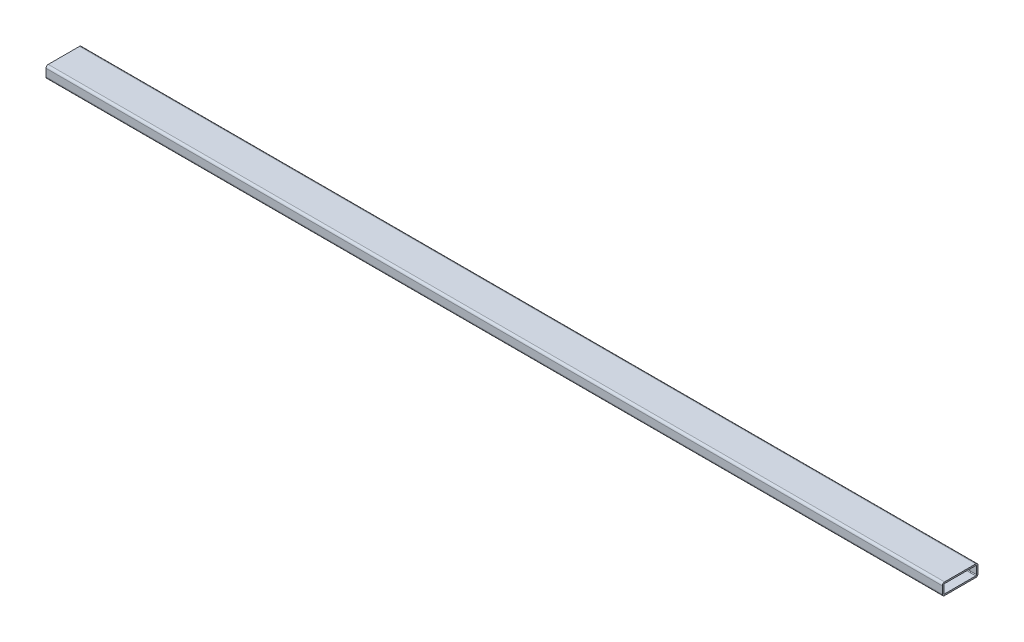
ISO-10303-21;
HEADER;
FILE_DESCRIPTION(('STEP AP214'),'2;1');
FILE_NAME('part.step','',(''),(''),'','','');
FILE_SCHEMA(('AUTOMOTIVE_DESIGN { 1 0 10303 214 1 1 1 1 }'));
ENDSEC;
DATA;
#1=APPLICATION_CONTEXT('core data for automotive mechanical design processes');
#2=APPLICATION_PROTOCOL_DEFINITION('international standard','automotive_design',2000,#1);
#3=PRODUCT_CONTEXT('',#1,'mechanical');
#4=PRODUCT('Part','Part','',(#3));
#5=PRODUCT_RELATED_PRODUCT_CATEGORY('part','',(#4));
#6=PRODUCT_DEFINITION_FORMATION('','',#4);
#7=PRODUCT_DEFINITION_CONTEXT('part definition',#1,'design');
#8=PRODUCT_DEFINITION('design','',#6,#7);
#9=PRODUCT_DEFINITION_SHAPE('','',#8);
#10=(LENGTH_UNIT() NAMED_UNIT(*) SI_UNIT(.MILLI.,.METRE.));
#11=(NAMED_UNIT(*) PLANE_ANGLE_UNIT() SI_UNIT($,.RADIAN.));
#12=(NAMED_UNIT(*) SI_UNIT($,.STERADIAN.) SOLID_ANGLE_UNIT());
#13=UNCERTAINTY_MEASURE_WITH_UNIT(LENGTH_MEASURE(1.E-05),#10,'distance_accuracy_value','');
#14=(GEOMETRIC_REPRESENTATION_CONTEXT(3) GLOBAL_UNCERTAINTY_ASSIGNED_CONTEXT((#13)) GLOBAL_UNIT_ASSIGNED_CONTEXT((#10,
#11,#12)) REPRESENTATION_CONTEXT('',''));
#15=CARTESIAN_POINT('',(0.,0.,0.));
#16=DIRECTION('',(0.,0.,1.));
#17=DIRECTION('',(1.,0.,0.));
#18=AXIS2_PLACEMENT_3D('',#15,#16,#17);
#19=CARTESIAN_POINT('',(957.2625,20.6248,-33.3248));
#20=DIRECTION('',(1.,0.,0.));
#21=DIRECTION('',(0.,0.,-1.));
#22=AXIS2_PLACEMENT_3D('',#19,#20,#21);
#23=PLANE('',#22);
#24=CARTESIAN_POINT('',(957.2625,20.6248,-33.3248));
#25=DIRECTION('',(1.,0.,0.));
#26=DIRECTION('',(0.,0.,-1.));
#27=AXIS2_PLACEMENT_3D('',#24,#25,#26);
#28=CIRCLE('',#27,4.77519999999999);
#29=CARTESIAN_POINT('',(957.2625,20.6248,-38.1));
#30=VERTEX_POINT('',#29);
#31=CARTESIAN_POINT('',(957.2625,25.4,-33.3248));
#32=VERTEX_POINT('',#31);
#33=EDGE_CURVE('E213',#30,#32,#28,.T.);
#34=ORIENTED_EDGE('',*,*,#33,.T.);
#35=DIRECTION('',(0.,0.,1.));
#36=VECTOR('',#35,1.);
#37=CARTESIAN_POINT('',(957.2625,25.4,-33.3248));
#38=LINE('',#37,#36);
#39=CARTESIAN_POINT('',(957.2625,25.4,33.3248));
#40=VERTEX_POINT('',#39);
#41=EDGE_CURVE('E216',#32,#40,#38,.T.);
#42=ORIENTED_EDGE('',*,*,#41,.T.);
#43=CARTESIAN_POINT('',(957.2625,20.6248,33.3248));
#44=DIRECTION('',(1.,0.,0.));
#45=DIRECTION('',(0.,0.,1.));
#46=AXIS2_PLACEMENT_3D('',#43,#44,#45);
#47=CIRCLE('',#46,4.77519999999999);
#48=CARTESIAN_POINT('',(957.2625,20.6248,38.1));
#49=VERTEX_POINT('',#48);
#50=EDGE_CURVE('E219',#40,#49,#47,.T.);
#51=ORIENTED_EDGE('',*,*,#50,.T.);
#52=DIRECTION('',(0.,-1.,0.));
#53=VECTOR('',#52,1.);
#54=CARTESIAN_POINT('',(957.2625,20.6248,38.1));
#55=LINE('',#54,#53);
#56=CARTESIAN_POINT('',(957.2625,4.77519999999999,38.1));
#57=VERTEX_POINT('',#56);
#58=EDGE_CURVE('E221',#49,#57,#55,.T.);
#59=ORIENTED_EDGE('',*,*,#58,.T.);
#60=CARTESIAN_POINT('',(957.2625,4.77519999999999,33.3248));
#61=DIRECTION('',(1.,0.,0.));
#62=DIRECTION('',(0.,0.,1.));
#63=AXIS2_PLACEMENT_3D('',#60,#61,#62);
#64=CIRCLE('',#63,4.7752);
#65=CARTESIAN_POINT('',(957.2625,0.,33.3248));
#66=VERTEX_POINT('',#65);
#67=EDGE_CURVE('E223',#57,#66,#64,.T.);
#68=ORIENTED_EDGE('',*,*,#67,.T.);
#69=DIRECTION('',(0.,0.,-1.));
#70=VECTOR('',#69,1.);
#71=CARTESIAN_POINT('',(957.2625,0.,-33.3248));
#72=LINE('',#71,#70);
#73=CARTESIAN_POINT('',(957.2625,0.,-33.3248));
#74=VERTEX_POINT('',#73);
#75=EDGE_CURVE('E225',#66,#74,#72,.T.);
#76=ORIENTED_EDGE('',*,*,#75,.T.);
#77=CARTESIAN_POINT('',(957.2625,4.77520000000001,-33.3248));
#78=DIRECTION('',(1.,0.,0.));
#79=DIRECTION('',(0.,0.,1.));
#80=AXIS2_PLACEMENT_3D('',#77,#78,#79);
#81=CIRCLE('',#80,4.7752);
#82=CARTESIAN_POINT('',(957.2625,4.77520000000001,-38.1));
#83=VERTEX_POINT('',#82);
#84=EDGE_CURVE('E227',#74,#83,#81,.T.);
#85=ORIENTED_EDGE('',*,*,#84,.T.);
#86=DIRECTION('',(0.,1.,0.));
#87=VECTOR('',#86,1.);
#88=CARTESIAN_POINT('',(957.2625,20.6248,-38.1));
#89=LINE('',#88,#87);
#90=EDGE_CURVE('E229',#83,#30,#89,.T.);
#91=ORIENTED_EDGE('',*,*,#90,.T.);
#92=EDGE_LOOP('',(#34,#42,#51,#59,#68,#76,#85,#91));
#93=FACE_BOUND('',#92,.T.);
#94=DIRECTION('',(0.,0.,1.));
#95=VECTOR('',#94,1.);
#96=CARTESIAN_POINT('',(957.2625,22.225,-33.3248));
#97=LINE('',#96,#95);
#98=CARTESIAN_POINT('',(957.2625,22.225,-33.3248));
#99=VERTEX_POINT('',#98);
#100=CARTESIAN_POINT('',(957.2625,22.225,33.3248));
#101=VERTEX_POINT('',#100);
#102=EDGE_CURVE('E156',#99,#101,#97,.T.);
#103=ORIENTED_EDGE('',*,*,#102,.F.);
#104=CARTESIAN_POINT('',(957.2625,20.6248,-33.3248));
#105=DIRECTION('',(1.,0.,0.));
#106=DIRECTION('',(0.,0.,-1.));
#107=AXIS2_PLACEMENT_3D('',#104,#105,#106);
#108=CIRCLE('',#107,1.6002);
#109=CARTESIAN_POINT('',(957.2625,20.6248,-34.925));
#110=VERTEX_POINT('',#109);
#111=EDGE_CURVE('E148',#110,#99,#108,.T.);
#112=ORIENTED_EDGE('',*,*,#111,.F.);
#113=DIRECTION('',(0.,1.,0.));
#114=VECTOR('',#113,1.);
#115=CARTESIAN_POINT('',(957.2625,20.6248,-34.925));
#116=LINE('',#115,#114);
#117=CARTESIAN_POINT('',(957.2625,4.77520000000001,-34.925));
#118=VERTEX_POINT('',#117);
#119=EDGE_CURVE('E181',#118,#110,#116,.T.);
#120=ORIENTED_EDGE('',*,*,#119,.F.);
#121=CARTESIAN_POINT('',(957.2625,4.77520000000001,-33.3248));
#122=DIRECTION('',(1.,0.,0.));
#123=DIRECTION('',(0.,0.,1.));
#124=AXIS2_PLACEMENT_3D('',#121,#122,#123);
#125=CIRCLE('',#124,1.6002);
#126=CARTESIAN_POINT('',(957.2625,3.17500000000001,-33.3248));
#127=VERTEX_POINT('',#126);
#128=EDGE_CURVE('E179',#127,#118,#125,.T.);
#129=ORIENTED_EDGE('',*,*,#128,.F.);
#130=DIRECTION('',(0.,0.,-1.));
#131=VECTOR('',#130,1.);
#132=CARTESIAN_POINT('',(957.2625,3.17500000000001,-33.3248));
#133=LINE('',#132,#131);
#134=CARTESIAN_POINT('',(957.2625,3.17499999999999,33.3248));
#135=VERTEX_POINT('',#134);
#136=EDGE_CURVE('E177',#135,#127,#133,.T.);
#137=ORIENTED_EDGE('',*,*,#136,.F.);
#138=CARTESIAN_POINT('',(957.2625,4.77519999999999,33.3248));
#139=DIRECTION('',(1.,0.,0.));
#140=DIRECTION('',(0.,0.,1.));
#141=AXIS2_PLACEMENT_3D('',#138,#139,#140);
#142=CIRCLE('',#141,1.60020000000001);
#143=CARTESIAN_POINT('',(957.2625,4.77519999999999,34.925));
#144=VERTEX_POINT('',#143);
#145=EDGE_CURVE('E175',#144,#135,#142,.T.);
#146=ORIENTED_EDGE('',*,*,#145,.F.);
#147=DIRECTION('',(0.,-1.,0.));
#148=VECTOR('',#147,1.);
#149=CARTESIAN_POINT('',(957.2625,20.6248,34.925));
#150=LINE('',#149,#148);
#151=CARTESIAN_POINT('',(957.2625,20.6248,34.925));
#152=VERTEX_POINT('',#151);
#153=EDGE_CURVE('E171',#152,#144,#150,.T.);
#154=ORIENTED_EDGE('',*,*,#153,.F.);
#155=CARTESIAN_POINT('',(957.2625,20.6248,33.3248));
#156=DIRECTION('',(1.,0.,0.));
#157=DIRECTION('',(0.,0.,1.));
#158=AXIS2_PLACEMENT_3D('',#155,#156,#157);
#159=CIRCLE('',#158,1.60020000000001);
#160=EDGE_CURVE('E169',#101,#152,#159,.T.);
#161=ORIENTED_EDGE('',*,*,#160,.F.);
#162=EDGE_LOOP('',(#103,#112,#120,#129,#137,#146,#154,#161));
#163=FACE_BOUND('',#162,.T.);
#164=ADVANCED_FACE('F35',(#93,#163),#23,.T.);
#165=CARTESIAN_POINT('',(-957.2625,20.6248,-33.3248));
#166=DIRECTION('',(1.,0.,0.));
#167=DIRECTION('',(0.,0.,-1.));
#168=AXIS2_PLACEMENT_3D('',#165,#166,#167);
#169=PLANE('',#168);
#170=CARTESIAN_POINT('',(-957.2625,20.6248,-33.3248));
#171=DIRECTION('',(1.,0.,0.));
#172=DIRECTION('',(0.,0.,-1.));
#173=AXIS2_PLACEMENT_3D('',#170,#171,#172);
#174=CIRCLE('',#173,4.77519999999999);
#175=CARTESIAN_POINT('',(-957.2625,20.6248,-38.1));
#176=VERTEX_POINT('',#175);
#177=CARTESIAN_POINT('',(-957.2625,25.4,-33.3248));
#178=VERTEX_POINT('',#177);
#179=EDGE_CURVE('E164',#176,#178,#174,.T.);
#180=ORIENTED_EDGE('',*,*,#179,.F.);
#181=DIRECTION('',(0.,1.,0.));
#182=VECTOR('',#181,1.);
#183=CARTESIAN_POINT('',(-957.2625,20.6248,-38.1));
#184=LINE('',#183,#182);
#185=CARTESIAN_POINT('',(-957.2625,4.77520000000001,-38.1));
#186=VERTEX_POINT('',#185);
#187=EDGE_CURVE('E217',#186,#176,#184,.T.);
#188=ORIENTED_EDGE('',*,*,#187,.F.);
#189=CARTESIAN_POINT('',(-957.2625,4.77520000000001,-33.3248));
#190=DIRECTION('',(1.,0.,0.));
#191=DIRECTION('',(0.,0.,1.));
#192=AXIS2_PLACEMENT_3D('',#189,#190,#191);
#193=CIRCLE('',#192,4.7752);
#194=CARTESIAN_POINT('',(-957.2625,0.,-33.3248));
#195=VERTEX_POINT('',#194);
#196=EDGE_CURVE('E244',#195,#186,#193,.T.);
#197=ORIENTED_EDGE('',*,*,#196,.F.);
#198=DIRECTION('',(0.,0.,-1.));
#199=VECTOR('',#198,1.);
#200=CARTESIAN_POINT('',(-957.2625,0.,-33.3248));
#201=LINE('',#200,#199);
#202=CARTESIAN_POINT('',(-957.2625,0.,33.3248));
#203=VERTEX_POINT('',#202);
#204=EDGE_CURVE('E242',#203,#195,#201,.T.);
#205=ORIENTED_EDGE('',*,*,#204,.F.);
#206=CARTESIAN_POINT('',(-957.2625,4.77519999999999,33.3248));
#207=DIRECTION('',(1.,0.,0.));
#208=DIRECTION('',(0.,0.,1.));
#209=AXIS2_PLACEMENT_3D('',#206,#207,#208);
#210=CIRCLE('',#209,4.7752);
#211=CARTESIAN_POINT('',(-957.2625,4.77519999999999,38.1));
#212=VERTEX_POINT('',#211);
#213=EDGE_CURVE('E240',#212,#203,#210,.T.);
#214=ORIENTED_EDGE('',*,*,#213,.F.);
#215=DIRECTION('',(0.,-1.,0.));
#216=VECTOR('',#215,1.);
#217=CARTESIAN_POINT('',(-957.2625,20.6248,38.1));
#218=LINE('',#217,#216);
#219=CARTESIAN_POINT('',(-957.2625,20.6248,38.1));
#220=VERTEX_POINT('',#219);
#221=EDGE_CURVE('E238',#220,#212,#218,.T.);
#222=ORIENTED_EDGE('',*,*,#221,.F.);
#223=CARTESIAN_POINT('',(-957.2625,20.6248,33.3248));
#224=DIRECTION('',(1.,0.,0.));
#225=DIRECTION('',(0.,0.,1.));
#226=AXIS2_PLACEMENT_3D('',#223,#224,#225);
#227=CIRCLE('',#226,4.77519999999999);
#228=CARTESIAN_POINT('',(-957.2625,25.4,33.3248));
#229=VERTEX_POINT('',#228);
#230=EDGE_CURVE('E236',#229,#220,#227,.T.);
#231=ORIENTED_EDGE('',*,*,#230,.F.);
#232=DIRECTION('',(0.,0.,1.));
#233=VECTOR('',#232,1.);
#234=CARTESIAN_POINT('',(-957.2625,25.4,-33.3248));
#235=LINE('',#234,#233);
#236=EDGE_CURVE('E234',#178,#229,#235,.T.);
#237=ORIENTED_EDGE('',*,*,#236,.F.);
#238=EDGE_LOOP('',(#180,#188,#197,#205,#214,#222,#231,#237));
#239=FACE_BOUND('',#238,.T.);
#240=CARTESIAN_POINT('',(-957.2625,20.6248,-33.3248));
#241=DIRECTION('',(1.,0.,0.));
#242=DIRECTION('',(0.,0.,-1.));
#243=AXIS2_PLACEMENT_3D('',#240,#241,#242);
#244=CIRCLE('',#243,1.6002);
#245=CARTESIAN_POINT('',(-957.2625,20.6248,-34.925));
#246=VERTEX_POINT('',#245);
#247=CARTESIAN_POINT('',(-957.2625,22.225,-33.3248));
#248=VERTEX_POINT('',#247);
#249=EDGE_CURVE('E58',#246,#248,#244,.T.);
#250=ORIENTED_EDGE('',*,*,#249,.T.);
#251=DIRECTION('',(0.,0.,1.));
#252=VECTOR('',#251,1.);
#253=CARTESIAN_POINT('',(-957.2625,22.225,-33.3248));
#254=LINE('',#253,#252);
#255=CARTESIAN_POINT('',(-957.2625,22.225,33.3248));
#256=VERTEX_POINT('',#255);
#257=EDGE_CURVE('E163',#248,#256,#254,.T.);
#258=ORIENTED_EDGE('',*,*,#257,.T.);
#259=CARTESIAN_POINT('',(-957.2625,20.6248,33.3248));
#260=DIRECTION('',(1.,0.,0.));
#261=DIRECTION('',(0.,0.,1.));
#262=AXIS2_PLACEMENT_3D('',#259,#260,#261);
#263=CIRCLE('',#262,1.60020000000001);
#264=CARTESIAN_POINT('',(-957.2625,20.6248,34.925));
#265=VERTEX_POINT('',#264);
#266=EDGE_CURVE('E185',#256,#265,#263,.T.);
#267=ORIENTED_EDGE('',*,*,#266,.T.);
#268=DIRECTION('',(0.,-1.,0.));
#269=VECTOR('',#268,1.);
#270=CARTESIAN_POINT('',(-957.2625,20.6248,34.925));
#271=LINE('',#270,#269);
#272=CARTESIAN_POINT('',(-957.2625,4.77519999999999,34.925));
#273=VERTEX_POINT('',#272);
#274=EDGE_CURVE('E188',#265,#273,#271,.T.);
#275=ORIENTED_EDGE('',*,*,#274,.T.);
#276=CARTESIAN_POINT('',(-957.2625,4.77519999999999,33.3248));
#277=DIRECTION('',(1.,0.,0.));
#278=DIRECTION('',(0.,0.,1.));
#279=AXIS2_PLACEMENT_3D('',#276,#277,#278);
#280=CIRCLE('',#279,1.60020000000001);
#281=CARTESIAN_POINT('',(-957.2625,3.17499999999999,33.3248));
#282=VERTEX_POINT('',#281);
#283=EDGE_CURVE('E191',#273,#282,#280,.T.);
#284=ORIENTED_EDGE('',*,*,#283,.T.);
#285=DIRECTION('',(0.,0.,-1.));
#286=VECTOR('',#285,1.);
#287=CARTESIAN_POINT('',(-957.2625,3.17500000000001,-33.3248));
#288=LINE('',#287,#286);
#289=CARTESIAN_POINT('',(-957.2625,3.17500000000001,-33.3248));
#290=VERTEX_POINT('',#289);
#291=EDGE_CURVE('E194',#282,#290,#288,.T.);
#292=ORIENTED_EDGE('',*,*,#291,.T.);
#293=CARTESIAN_POINT('',(-957.2625,4.77520000000001,-33.3248));
#294=DIRECTION('',(1.,0.,0.));
#295=DIRECTION('',(0.,0.,1.));
#296=AXIS2_PLACEMENT_3D('',#293,#294,#295);
#297=CIRCLE('',#296,1.6002);
#298=CARTESIAN_POINT('',(-957.2625,4.77520000000001,-34.925));
#299=VERTEX_POINT('',#298);
#300=EDGE_CURVE('E197',#290,#299,#297,.T.);
#301=ORIENTED_EDGE('',*,*,#300,.T.);
#302=DIRECTION('',(0.,1.,0.));
#303=VECTOR('',#302,1.);
#304=CARTESIAN_POINT('',(-957.2625,20.6248,-34.925));
#305=LINE('',#304,#303);
#306=EDGE_CURVE('E157',#299,#246,#305,.T.);
#307=ORIENTED_EDGE('',*,*,#306,.T.);
#308=EDGE_LOOP('',(#250,#258,#267,#275,#284,#292,#301,#307));
#309=FACE_BOUND('',#308,.T.);
#310=ADVANCED_FACE('F274',(#239,#309),#169,.F.);
#311=CARTESIAN_POINT('',(957.2625,20.6248,-33.3248));
#312=DIRECTION('',(-1.,0.,0.));
#313=DIRECTION('',(0.,0.,1.));
#314=AXIS2_PLACEMENT_3D('',#311,#312,#313);
#315=CYLINDRICAL_SURFACE('',#314,4.77519999999999);
#316=ORIENTED_EDGE('',*,*,#179,.T.);
#317=DIRECTION('',(-1.,0.,0.));
#318=VECTOR('',#317,1.);
#319=CARTESIAN_POINT('',(957.2625,25.4,-33.3248));
#320=LINE('',#319,#318);
#321=EDGE_CURVE('E11',#32,#178,#320,.T.);
#322=ORIENTED_EDGE('',*,*,#321,.F.);
#323=ORIENTED_EDGE('',*,*,#33,.F.);
#324=DIRECTION('',(-1.,0.,0.));
#325=VECTOR('',#324,1.);
#326=CARTESIAN_POINT('',(957.2625,20.6248,-38.1));
#327=LINE('',#326,#325);
#328=EDGE_CURVE('E231',#30,#176,#327,.T.);
#329=ORIENTED_EDGE('',*,*,#328,.T.);
#330=EDGE_LOOP('',(#316,#322,#323,#329));
#331=FACE_BOUND('',#330,.T.);
#332=ADVANCED_FACE('F37',(#331),#315,.T.);
#333=CARTESIAN_POINT('',(957.2625,25.4,-33.3248));
#334=DIRECTION('',(0.,-1.,0.));
#335=DIRECTION('',(0.,0.,-1.));
#336=AXIS2_PLACEMENT_3D('',#333,#334,#335);
#337=PLANE('',#336);
#338=ORIENTED_EDGE('',*,*,#236,.T.);
#339=DIRECTION('',(-1.,0.,0.));
#340=VECTOR('',#339,1.);
#341=CARTESIAN_POINT('',(957.2625,25.4,33.3248));
#342=LINE('',#341,#340);
#343=EDGE_CURVE('E43',#40,#229,#342,.T.);
#344=ORIENTED_EDGE('',*,*,#343,.F.);
#345=ORIENTED_EDGE('',*,*,#41,.F.);
#346=ORIENTED_EDGE('',*,*,#321,.T.);
#347=EDGE_LOOP('',(#338,#344,#345,#346));
#348=FACE_BOUND('',#347,.T.);
#349=ADVANCED_FACE('F291',(#348),#337,.F.);
#350=CARTESIAN_POINT('',(957.2625,20.6248,33.3248));
#351=DIRECTION('',(-1.,0.,0.));
#352=DIRECTION('',(0.,0.,1.));
#353=AXIS2_PLACEMENT_3D('',#350,#351,#352);
#354=CYLINDRICAL_SURFACE('',#353,4.77519999999999);
#355=ORIENTED_EDGE('',*,*,#230,.T.);
#356=DIRECTION('',(-1.,0.,0.));
#357=VECTOR('',#356,1.);
#358=CARTESIAN_POINT('',(957.2625,20.6248,38.1));
#359=LINE('',#358,#357);
#360=EDGE_CURVE('E261',#49,#220,#359,.T.);
#361=ORIENTED_EDGE('',*,*,#360,.F.);
#362=ORIENTED_EDGE('',*,*,#50,.F.);
#363=ORIENTED_EDGE('',*,*,#343,.T.);
#364=EDGE_LOOP('',(#355,#361,#362,#363));
#365=FACE_BOUND('',#364,.T.);
#366=ADVANCED_FACE('F268',(#365),#354,.T.);
#367=CARTESIAN_POINT('',(957.2625,20.6248,38.1));
#368=DIRECTION('',(0.,0.,-1.));
#369=DIRECTION('',(0.,1.,0.));
#370=AXIS2_PLACEMENT_3D('',#367,#368,#369);
#371=PLANE('',#370);
#372=ORIENTED_EDGE('',*,*,#221,.T.);
#373=DIRECTION('',(-1.,0.,0.));
#374=VECTOR('',#373,1.);
#375=CARTESIAN_POINT('',(957.2625,4.77519999999999,38.1));
#376=LINE('',#375,#374);
#377=EDGE_CURVE('E258',#57,#212,#376,.T.);
#378=ORIENTED_EDGE('',*,*,#377,.F.);
#379=ORIENTED_EDGE('',*,*,#58,.F.);
#380=ORIENTED_EDGE('',*,*,#360,.T.);
#381=EDGE_LOOP('',(#372,#378,#379,#380));
#382=FACE_BOUND('',#381,.T.);
#383=ADVANCED_FACE('F280',(#382),#371,.F.);
#384=CARTESIAN_POINT('',(957.2625,4.77519999999999,33.3248));
#385=DIRECTION('',(-1.,0.,0.));
#386=DIRECTION('',(0.,0.,1.));
#387=AXIS2_PLACEMENT_3D('',#384,#385,#386);
#388=CYLINDRICAL_SURFACE('',#387,4.7752);
#389=ORIENTED_EDGE('',*,*,#213,.T.);
#390=DIRECTION('',(-1.,0.,0.));
#391=VECTOR('',#390,1.);
#392=CARTESIAN_POINT('',(957.2625,0.,33.3248));
#393=LINE('',#392,#391);
#394=EDGE_CURVE('E255',#66,#203,#393,.T.);
#395=ORIENTED_EDGE('',*,*,#394,.F.);
#396=ORIENTED_EDGE('',*,*,#67,.F.);
#397=ORIENTED_EDGE('',*,*,#377,.T.);
#398=EDGE_LOOP('',(#389,#395,#396,#397));
#399=FACE_BOUND('',#398,.T.);
#400=ADVANCED_FACE('F284',(#399),#388,.T.);
#401=CARTESIAN_POINT('',(957.2625,0.,-33.3248));
#402=DIRECTION('',(0.,1.,0.));
#403=DIRECTION('',(0.,0.,1.));
#404=AXIS2_PLACEMENT_3D('',#401,#402,#403);
#405=PLANE('',#404);
#406=ORIENTED_EDGE('',*,*,#204,.T.);
#407=DIRECTION('',(-1.,0.,0.));
#408=VECTOR('',#407,1.);
#409=CARTESIAN_POINT('',(957.2625,0.,-33.3248));
#410=LINE('',#409,#408);
#411=EDGE_CURVE('E252',#74,#195,#410,.T.);
#412=ORIENTED_EDGE('',*,*,#411,.F.);
#413=ORIENTED_EDGE('',*,*,#75,.F.);
#414=ORIENTED_EDGE('',*,*,#394,.T.);
#415=EDGE_LOOP('',(#406,#412,#413,#414));
#416=FACE_BOUND('',#415,.T.);
#417=ADVANCED_FACE('F304',(#416),#405,.F.);
#418=CARTESIAN_POINT('',(957.2625,4.77520000000001,-33.3248));
#419=DIRECTION('',(-1.,0.,0.));
#420=DIRECTION('',(0.,0.,1.));
#421=AXIS2_PLACEMENT_3D('',#418,#419,#420);
#422=CYLINDRICAL_SURFACE('',#421,4.7752);
#423=ORIENTED_EDGE('',*,*,#196,.T.);
#424=DIRECTION('',(-1.,0.,0.));
#425=VECTOR('',#424,1.);
#426=CARTESIAN_POINT('',(957.2625,4.77520000000001,-38.1));
#427=LINE('',#426,#425);
#428=EDGE_CURVE('E249',#83,#186,#427,.T.);
#429=ORIENTED_EDGE('',*,*,#428,.F.);
#430=ORIENTED_EDGE('',*,*,#84,.F.);
#431=ORIENTED_EDGE('',*,*,#411,.T.);
#432=EDGE_LOOP('',(#423,#429,#430,#431));
#433=FACE_BOUND('',#432,.T.);
#434=ADVANCED_FACE('F302',(#433),#422,.T.);
#435=CARTESIAN_POINT('',(957.2625,20.6248,-38.1));
#436=DIRECTION('',(0.,0.,1.));
#437=DIRECTION('',(0.,-1.,0.));
#438=AXIS2_PLACEMENT_3D('',#435,#436,#437);
#439=PLANE('',#438);
#440=ORIENTED_EDGE('',*,*,#187,.T.);
#441=ORIENTED_EDGE('',*,*,#328,.F.);
#442=ORIENTED_EDGE('',*,*,#90,.F.);
#443=ORIENTED_EDGE('',*,*,#428,.T.);
#444=EDGE_LOOP('',(#440,#441,#442,#443));
#445=FACE_BOUND('',#444,.T.);
#446=ADVANCED_FACE('F297',(#445),#439,.F.);
#447=CARTESIAN_POINT('',(957.2625,20.6248,-33.3248));
#448=DIRECTION('',(-1.,0.,0.));
#449=DIRECTION('',(0.,0.,1.));
#450=AXIS2_PLACEMENT_3D('',#447,#448,#449);
#451=CYLINDRICAL_SURFACE('',#450,1.6002);
#452=ORIENTED_EDGE('',*,*,#249,.F.);
#453=DIRECTION('',(-1.,0.,0.));
#454=VECTOR('',#453,1.);
#455=CARTESIAN_POINT('',(957.2625,20.6248,-34.925));
#456=LINE('',#455,#454);
#457=EDGE_CURVE('E152',#110,#246,#456,.T.);
#458=ORIENTED_EDGE('',*,*,#457,.F.);
#459=ORIENTED_EDGE('',*,*,#111,.T.);
#460=DIRECTION('',(-1.,0.,0.));
#461=VECTOR('',#460,1.);
#462=CARTESIAN_POINT('',(957.2625,22.225,-33.3248));
#463=LINE('',#462,#461);
#464=EDGE_CURVE('E151',#99,#248,#463,.T.);
#465=ORIENTED_EDGE('',*,*,#464,.T.);
#466=EDGE_LOOP('',(#452,#458,#459,#465));
#467=FACE_BOUND('',#466,.T.);
#468=ADVANCED_FACE('F150',(#467),#451,.F.);
#469=CARTESIAN_POINT('',(957.2625,22.225,-33.3248));
#470=DIRECTION('',(0.,-1.,0.));
#471=DIRECTION('',(0.,0.,-1.));
#472=AXIS2_PLACEMENT_3D('',#469,#470,#471);
#473=PLANE('',#472);
#474=ORIENTED_EDGE('',*,*,#257,.F.);
#475=ORIENTED_EDGE('',*,*,#464,.F.);
#476=ORIENTED_EDGE('',*,*,#102,.T.);
#477=DIRECTION('',(-1.,0.,0.));
#478=VECTOR('',#477,1.);
#479=CARTESIAN_POINT('',(957.2625,22.225,33.3248));
#480=LINE('',#479,#478);
#481=EDGE_CURVE('E165',#101,#256,#480,.T.);
#482=ORIENTED_EDGE('',*,*,#481,.T.);
#483=EDGE_LOOP('',(#474,#475,#476,#482));
#484=FACE_BOUND('',#483,.T.);
#485=ADVANCED_FACE('F160',(#484),#473,.T.);
#486=CARTESIAN_POINT('',(957.2625,20.6248,33.3248));
#487=DIRECTION('',(-1.,0.,0.));
#488=DIRECTION('',(0.,0.,1.));
#489=AXIS2_PLACEMENT_3D('',#486,#487,#488);
#490=CYLINDRICAL_SURFACE('',#489,1.60020000000001);
#491=ORIENTED_EDGE('',*,*,#266,.F.);
#492=ORIENTED_EDGE('',*,*,#481,.F.);
#493=ORIENTED_EDGE('',*,*,#160,.T.);
#494=DIRECTION('',(-1.,0.,0.));
#495=VECTOR('',#494,1.);
#496=CARTESIAN_POINT('',(957.2625,20.6248,34.925));
#497=LINE('',#496,#495);
#498=EDGE_CURVE('E210',#152,#265,#497,.T.);
#499=ORIENTED_EDGE('',*,*,#498,.T.);
#500=EDGE_LOOP('',(#491,#492,#493,#499));
#501=FACE_BOUND('',#500,.T.);
#502=ADVANCED_FACE('F329',(#501),#490,.F.);
#503=CARTESIAN_POINT('',(957.2625,20.6248,34.925));
#504=DIRECTION('',(0.,0.,-1.));
#505=DIRECTION('',(-1.,0.,0.));
#506=AXIS2_PLACEMENT_3D('',#503,#504,#505);
#507=PLANE('',#506);
#508=ORIENTED_EDGE('',*,*,#274,.F.);
#509=ORIENTED_EDGE('',*,*,#498,.F.);
#510=ORIENTED_EDGE('',*,*,#153,.T.);
#511=DIRECTION('',(-1.,0.,0.));
#512=VECTOR('',#511,1.);
#513=CARTESIAN_POINT('',(957.2625,4.77519999999999,34.925));
#514=LINE('',#513,#512);
#515=EDGE_CURVE('E208',#144,#273,#514,.T.);
#516=ORIENTED_EDGE('',*,*,#515,.T.);
#517=EDGE_LOOP('',(#508,#509,#510,#516));
#518=FACE_BOUND('',#517,.T.);
#519=ADVANCED_FACE('F333',(#518),#507,.T.);
#520=CARTESIAN_POINT('',(957.2625,4.77519999999999,33.3248));
#521=DIRECTION('',(-1.,0.,0.));
#522=DIRECTION('',(0.,0.,1.));
#523=AXIS2_PLACEMENT_3D('',#520,#521,#522);
#524=CYLINDRICAL_SURFACE('',#523,1.60020000000001);
#525=ORIENTED_EDGE('',*,*,#283,.F.);
#526=ORIENTED_EDGE('',*,*,#515,.F.);
#527=ORIENTED_EDGE('',*,*,#145,.T.);
#528=DIRECTION('',(-1.,0.,0.));
#529=VECTOR('',#528,1.);
#530=CARTESIAN_POINT('',(957.2625,3.17499999999999,33.3248));
#531=LINE('',#530,#529);
#532=EDGE_CURVE('E206',#135,#282,#531,.T.);
#533=ORIENTED_EDGE('',*,*,#532,.T.);
#534=EDGE_LOOP('',(#525,#526,#527,#533));
#535=FACE_BOUND('',#534,.T.);
#536=ADVANCED_FACE('F339',(#535),#524,.F.);
#537=CARTESIAN_POINT('',(957.2625,3.17500000000001,-33.3248));
#538=DIRECTION('',(0.,1.,0.));
#539=DIRECTION('',(0.,0.,1.));
#540=AXIS2_PLACEMENT_3D('',#537,#538,#539);
#541=PLANE('',#540);
#542=ORIENTED_EDGE('',*,*,#291,.F.);
#543=ORIENTED_EDGE('',*,*,#532,.F.);
#544=ORIENTED_EDGE('',*,*,#136,.T.);
#545=DIRECTION('',(-1.,0.,0.));
#546=VECTOR('',#545,1.);
#547=CARTESIAN_POINT('',(957.2625,3.17500000000001,-33.3248));
#548=LINE('',#547,#546);
#549=EDGE_CURVE('E204',#127,#290,#548,.T.);
#550=ORIENTED_EDGE('',*,*,#549,.T.);
#551=EDGE_LOOP('',(#542,#543,#544,#550));
#552=FACE_BOUND('',#551,.T.);
#553=ADVANCED_FACE('F343',(#552),#541,.T.);
#554=CARTESIAN_POINT('',(957.2625,4.77520000000001,-33.3248));
#555=DIRECTION('',(-1.,0.,0.));
#556=DIRECTION('',(0.,0.,1.));
#557=AXIS2_PLACEMENT_3D('',#554,#555,#556);
#558=CYLINDRICAL_SURFACE('',#557,1.6002);
#559=ORIENTED_EDGE('',*,*,#300,.F.);
#560=ORIENTED_EDGE('',*,*,#549,.F.);
#561=ORIENTED_EDGE('',*,*,#128,.T.);
#562=DIRECTION('',(-1.,0.,0.));
#563=VECTOR('',#562,1.);
#564=CARTESIAN_POINT('',(957.2625,4.77520000000001,-34.925));
#565=LINE('',#564,#563);
#566=EDGE_CURVE('E50',#118,#299,#565,.T.);
#567=ORIENTED_EDGE('',*,*,#566,.T.);
#568=EDGE_LOOP('',(#559,#560,#561,#567));
#569=FACE_BOUND('',#568,.T.);
#570=ADVANCED_FACE('F347',(#569),#558,.F.);
#571=CARTESIAN_POINT('',(957.2625,20.6248,-34.925));
#572=DIRECTION('',(0.,0.,1.));
#573=DIRECTION('',(0.,-1.,0.));
#574=AXIS2_PLACEMENT_3D('',#571,#572,#573);
#575=PLANE('',#574);
#576=ORIENTED_EDGE('',*,*,#306,.F.);
#577=ORIENTED_EDGE('',*,*,#566,.F.);
#578=ORIENTED_EDGE('',*,*,#119,.T.);
#579=ORIENTED_EDGE('',*,*,#457,.T.);
#580=EDGE_LOOP('',(#576,#577,#578,#579));
#581=FACE_BOUND('',#580,.T.);
#582=ADVANCED_FACE('F351',(#581),#575,.T.);
#583=CLOSED_SHELL('',(#164,#310,#332,#349,#366,#383,#400,#417,#434,#446,#468,#485,#502,#519,
#536,#553,#570,#582));
#584=MANIFOLD_SOLID_BREP('B2',#583);
#585=ADVANCED_BREP_SHAPE_REPRESENTATION('',(#18,#584),#14);
#586=SHAPE_DEFINITION_REPRESENTATION(#9,#585);
ENDSEC;
END-ISO-10303-21;
